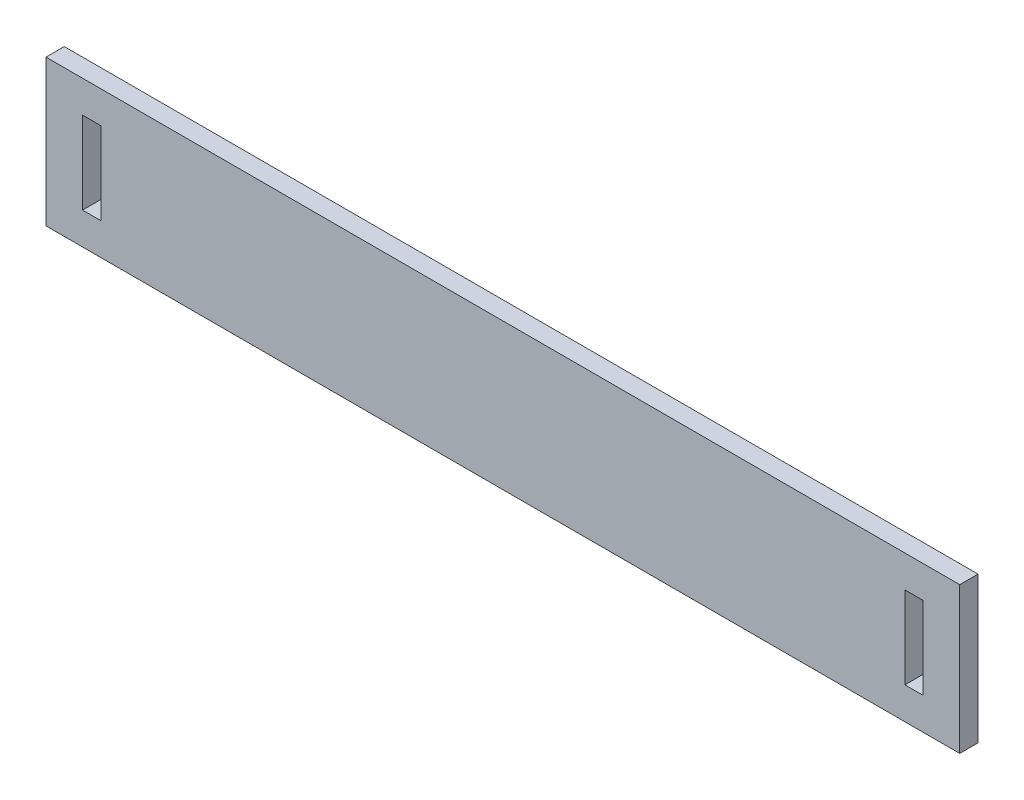
ISO-10303-21;
HEADER;
FILE_DESCRIPTION(('STEP AP214'),'2;1');
FILE_NAME('part.step','',(''),(''),'','','');
FILE_SCHEMA(('AUTOMOTIVE_DESIGN { 1 0 10303 214 1 1 1 1 }'));
ENDSEC;
DATA;
#1=APPLICATION_CONTEXT('core data for automotive mechanical design processes');
#2=APPLICATION_PROTOCOL_DEFINITION('international standard','automotive_design',2000,#1);
#3=PRODUCT_CONTEXT('',#1,'mechanical');
#4=PRODUCT('Part','Part','',(#3));
#5=PRODUCT_RELATED_PRODUCT_CATEGORY('part','',(#4));
#6=PRODUCT_DEFINITION_FORMATION('','',#4);
#7=PRODUCT_DEFINITION_CONTEXT('part definition',#1,'design');
#8=PRODUCT_DEFINITION('design','',#6,#7);
#9=PRODUCT_DEFINITION_SHAPE('','',#8);
#10=(LENGTH_UNIT() NAMED_UNIT(*) SI_UNIT(.MILLI.,.METRE.));
#11=(NAMED_UNIT(*) PLANE_ANGLE_UNIT() SI_UNIT($,.RADIAN.));
#12=(NAMED_UNIT(*) SI_UNIT($,.STERADIAN.) SOLID_ANGLE_UNIT());
#13=UNCERTAINTY_MEASURE_WITH_UNIT(LENGTH_MEASURE(1.E-05),#10,'distance_accuracy_value','');
#14=(GEOMETRIC_REPRESENTATION_CONTEXT(3) GLOBAL_UNCERTAINTY_ASSIGNED_CONTEXT((#13)) GLOBAL_UNIT_ASSIGNED_CONTEXT((#10,
#11,#12)) REPRESENTATION_CONTEXT('',''));
#15=CARTESIAN_POINT('',(0.,0.,0.));
#16=DIRECTION('',(0.,0.,1.));
#17=DIRECTION('',(1.,0.,0.));
#18=AXIS2_PLACEMENT_3D('',#15,#16,#17);
#19=CARTESIAN_POINT('',(-62.1174091184073,42.8700956937799,4.));
#20=DIRECTION('',(1.,0.,0.));
#21=DIRECTION('',(0.,0.,-1.));
#22=AXIS2_PLACEMENT_3D('',#19,#20,#21);
#23=PLANE('',#22);
#24=DIRECTION('',(0.,-1.,0.));
#25=VECTOR('',#24,1.);
#26=CARTESIAN_POINT('',(-62.1174091184073,42.8700956937799,0.));
#27=LINE('',#26,#25);
#28=CARTESIAN_POINT('',(-62.1174091184073,42.8700956937799,0.));
#29=VERTEX_POINT('',#28);
#30=CARTESIAN_POINT('',(-62.1174091184073,10.8700956937799,0.));
#31=VERTEX_POINT('',#30);
#32=EDGE_CURVE('E183',#29,#31,#27,.T.);
#33=ORIENTED_EDGE('',*,*,#32,.T.);
#34=DIRECTION('',(0.,0.,-1.));
#35=VECTOR('',#34,1.);
#36=CARTESIAN_POINT('',(-62.1174091184073,10.8700956937799,4.));
#37=LINE('',#36,#35);
#38=CARTESIAN_POINT('',(-62.1174091184073,10.8700956937799,4.));
#39=VERTEX_POINT('',#38);
#40=EDGE_CURVE('E11',#39,#31,#37,.T.);
#41=ORIENTED_EDGE('',*,*,#40,.F.);
#42=DIRECTION('',(0.,-1.,0.));
#43=VECTOR('',#42,1.);
#44=CARTESIAN_POINT('',(-62.1174091184073,42.8700956937799,4.));
#45=LINE('',#44,#43);
#46=CARTESIAN_POINT('',(-62.1174091184073,42.8700956937799,4.));
#47=VERTEX_POINT('',#46);
#48=EDGE_CURVE('E190',#47,#39,#45,.T.);
#49=ORIENTED_EDGE('',*,*,#48,.F.);
#50=DIRECTION('',(0.,0.,-1.));
#51=VECTOR('',#50,1.);
#52=CARTESIAN_POINT('',(-62.1174091184073,42.8700956937799,4.));
#53=LINE('',#52,#51);
#54=EDGE_CURVE('E200',#47,#29,#53,.T.);
#55=ORIENTED_EDGE('',*,*,#54,.T.);
#56=EDGE_LOOP('',(#33,#41,#49,#55));
#57=FACE_BOUND('',#56,.T.);
#58=ADVANCED_FACE('F33',(#57),#23,.F.);
#59=CARTESIAN_POINT('',(-62.1174091184073,10.8700956937799,4.));
#60=DIRECTION('',(0.,1.,0.));
#61=DIRECTION('',(0.,0.,1.));
#62=AXIS2_PLACEMENT_3D('',#59,#60,#61);
#63=PLANE('',#62);
#64=DIRECTION('',(1.,0.,0.));
#65=VECTOR('',#64,1.);
#66=CARTESIAN_POINT('',(-62.1174091184073,10.8700956937799,0.));
#67=LINE('',#66,#65);
#68=CARTESIAN_POINT('',(137.882590881593,10.8700956937799,0.));
#69=VERTEX_POINT('',#68);
#70=EDGE_CURVE('E203',#31,#69,#67,.T.);
#71=ORIENTED_EDGE('',*,*,#70,.T.);
#72=DIRECTION('',(0.,0.,-1.));
#73=VECTOR('',#72,1.);
#74=CARTESIAN_POINT('',(137.882590881593,10.8700956937799,4.));
#75=LINE('',#74,#73);
#76=CARTESIAN_POINT('',(137.882590881593,10.8700956937799,4.));
#77=VERTEX_POINT('',#76);
#78=EDGE_CURVE('E40',#77,#69,#75,.T.);
#79=ORIENTED_EDGE('',*,*,#78,.F.);
#80=DIRECTION('',(1.,0.,0.));
#81=VECTOR('',#80,1.);
#82=CARTESIAN_POINT('',(-62.1174091184073,10.8700956937799,4.));
#83=LINE('',#82,#81);
#84=EDGE_CURVE('E193',#39,#77,#83,.T.);
#85=ORIENTED_EDGE('',*,*,#84,.F.);
#86=ORIENTED_EDGE('',*,*,#40,.T.);
#87=EDGE_LOOP('',(#71,#79,#85,#86));
#88=FACE_BOUND('',#87,.T.);
#89=ADVANCED_FACE('F232',(#88),#63,.F.);
#90=CARTESIAN_POINT('',(137.882590881593,42.8700956937799,4.));
#91=DIRECTION('',(-1.,0.,0.));
#92=DIRECTION('',(0.,0.,1.));
#93=AXIS2_PLACEMENT_3D('',#90,#91,#92);
#94=PLANE('',#93);
#95=DIRECTION('',(0.,1.,0.));
#96=VECTOR('',#95,1.);
#97=CARTESIAN_POINT('',(137.882590881593,42.8700956937799,0.));
#98=LINE('',#97,#96);
#99=CARTESIAN_POINT('',(137.882590881593,42.8700956937799,0.));
#100=VERTEX_POINT('',#99);
#101=EDGE_CURVE('E205',#69,#100,#98,.T.);
#102=ORIENTED_EDGE('',*,*,#101,.T.);
#103=DIRECTION('',(0.,0.,-1.));
#104=VECTOR('',#103,1.);
#105=CARTESIAN_POINT('',(137.882590881593,42.8700956937799,4.));
#106=LINE('',#105,#104);
#107=CARTESIAN_POINT('',(137.882590881593,42.8700956937799,4.));
#108=VERTEX_POINT('',#107);
#109=EDGE_CURVE('E210',#108,#100,#106,.T.);
#110=ORIENTED_EDGE('',*,*,#109,.F.);
#111=DIRECTION('',(0.,1.,0.));
#112=VECTOR('',#111,1.);
#113=CARTESIAN_POINT('',(137.882590881593,42.8700956937799,4.));
#114=LINE('',#113,#112);
#115=EDGE_CURVE('E196',#77,#108,#114,.T.);
#116=ORIENTED_EDGE('',*,*,#115,.F.);
#117=ORIENTED_EDGE('',*,*,#78,.T.);
#118=EDGE_LOOP('',(#102,#110,#116,#117));
#119=FACE_BOUND('',#118,.T.);
#120=ADVANCED_FACE('F217',(#119),#94,.F.);
#121=CARTESIAN_POINT('',(-62.1174091184073,42.8700956937799,4.));
#122=DIRECTION('',(0.,-1.,0.));
#123=DIRECTION('',(0.,0.,-1.));
#124=AXIS2_PLACEMENT_3D('',#121,#122,#123);
#125=PLANE('',#124);
#126=DIRECTION('',(-1.,0.,0.));
#127=VECTOR('',#126,1.);
#128=CARTESIAN_POINT('',(-62.1174091184073,42.8700956937799,0.));
#129=LINE('',#128,#127);
#130=EDGE_CURVE('E194',#100,#29,#129,.T.);
#131=ORIENTED_EDGE('',*,*,#130,.T.);
#132=ORIENTED_EDGE('',*,*,#54,.F.);
#133=DIRECTION('',(-1.,0.,0.));
#134=VECTOR('',#133,1.);
#135=CARTESIAN_POINT('',(-62.1174091184073,42.8700956937799,4.));
#136=LINE('',#135,#134);
#137=EDGE_CURVE('E198',#108,#47,#136,.T.);
#138=ORIENTED_EDGE('',*,*,#137,.F.);
#139=ORIENTED_EDGE('',*,*,#109,.T.);
#140=EDGE_LOOP('',(#131,#132,#138,#139));
#141=FACE_BOUND('',#140,.T.);
#142=ADVANCED_FACE('F225',(#141),#125,.F.);
#143=CARTESIAN_POINT('',(0.,0.,4.));
#144=DIRECTION('',(0.,0.,1.));
#145=DIRECTION('',(1.,0.,0.));
#146=AXIS2_PLACEMENT_3D('',#143,#144,#145);
#147=PLANE('',#146);
#148=DIRECTION('',(0.,-1.,0.));
#149=VECTOR('',#148,1.);
#150=CARTESIAN_POINT('',(125.882590881593,35.8700956937799,4.));
#151=LINE('',#150,#149);
#152=CARTESIAN_POINT('',(125.882590881593,35.8700956937799,4.));
#153=VERTEX_POINT('',#152);
#154=CARTESIAN_POINT('',(125.882590881593,17.8700956937799,4.));
#155=VERTEX_POINT('',#154);
#156=EDGE_CURVE('E47',#153,#155,#151,.T.);
#157=ORIENTED_EDGE('',*,*,#156,.F.);
#158=DIRECTION('',(-1.,0.,0.));
#159=VECTOR('',#158,1.);
#160=CARTESIAN_POINT('',(125.882590881593,35.8700956937799,4.));
#161=LINE('',#160,#159);
#162=CARTESIAN_POINT('',(129.882590881593,35.8700956937799,4.));
#163=VERTEX_POINT('',#162);
#164=EDGE_CURVE('E139',#163,#153,#161,.T.);
#165=ORIENTED_EDGE('',*,*,#164,.F.);
#166=DIRECTION('',(0.,1.,0.));
#167=VECTOR('',#166,1.);
#168=CARTESIAN_POINT('',(129.882590881593,35.8700956937799,4.));
#169=LINE('',#168,#167);
#170=CARTESIAN_POINT('',(129.882590881593,17.8700956937799,4.));
#171=VERTEX_POINT('',#170);
#172=EDGE_CURVE('E142',#171,#163,#169,.T.);
#173=ORIENTED_EDGE('',*,*,#172,.F.);
#174=DIRECTION('',(1.,0.,0.));
#175=VECTOR('',#174,1.);
#176=CARTESIAN_POINT('',(125.882590881593,17.8700956937799,4.));
#177=LINE('',#176,#175);
#178=EDGE_CURVE('E148',#155,#171,#177,.T.);
#179=ORIENTED_EDGE('',*,*,#178,.F.);
#180=EDGE_LOOP('',(#157,#165,#173,#179));
#181=FACE_BOUND('',#180,.T.);
#182=DIRECTION('',(0.,-1.,0.));
#183=VECTOR('',#182,1.);
#184=CARTESIAN_POINT('',(-54.1174091184073,35.8700956937799,4.));
#185=LINE('',#184,#183);
#186=CARTESIAN_POINT('',(-54.1174091184073,35.8700956937799,4.));
#187=VERTEX_POINT('',#186);
#188=CARTESIAN_POINT('',(-54.1174091184073,17.8700956937799,4.));
#189=VERTEX_POINT('',#188);
#190=EDGE_CURVE('E154',#187,#189,#185,.T.);
#191=ORIENTED_EDGE('',*,*,#190,.F.);
#192=DIRECTION('',(-1.,0.,0.));
#193=VECTOR('',#192,1.);
#194=CARTESIAN_POINT('',(-54.1174091184073,35.8700956937799,4.));
#195=LINE('',#194,#193);
#196=CARTESIAN_POINT('',(-50.1174091184073,35.8700956937799,4.));
#197=VERTEX_POINT('',#196);
#198=EDGE_CURVE('E162',#197,#187,#195,.T.);
#199=ORIENTED_EDGE('',*,*,#198,.F.);
#200=DIRECTION('',(0.,1.,0.));
#201=VECTOR('',#200,1.);
#202=CARTESIAN_POINT('',(-50.1174091184073,35.8700956937799,4.));
#203=LINE('',#202,#201);
#204=CARTESIAN_POINT('',(-50.1174091184073,17.8700956937799,4.));
#205=VERTEX_POINT('',#204);
#206=EDGE_CURVE('E176',#205,#197,#203,.T.);
#207=ORIENTED_EDGE('',*,*,#206,.F.);
#208=DIRECTION('',(1.,0.,0.));
#209=VECTOR('',#208,1.);
#210=CARTESIAN_POINT('',(-54.1174091184073,17.8700956937799,4.));
#211=LINE('',#210,#209);
#212=EDGE_CURVE('E173',#189,#205,#211,.T.);
#213=ORIENTED_EDGE('',*,*,#212,.F.);
#214=EDGE_LOOP('',(#191,#199,#207,#213));
#215=FACE_BOUND('',#214,.T.);
#216=ORIENTED_EDGE('',*,*,#48,.T.);
#217=ORIENTED_EDGE('',*,*,#84,.T.);
#218=ORIENTED_EDGE('',*,*,#115,.T.);
#219=ORIENTED_EDGE('',*,*,#137,.T.);
#220=EDGE_LOOP('',(#216,#217,#218,#219));
#221=FACE_BOUND('',#220,.T.);
#222=ADVANCED_FACE('F231',(#181,#215,#221),#147,.T.);
#223=CARTESIAN_POINT('',(0.,0.,0.));
#224=DIRECTION('',(0.,0.,1.));
#225=DIRECTION('',(1.,0.,0.));
#226=AXIS2_PLACEMENT_3D('',#223,#224,#225);
#227=PLANE('',#226);
#228=DIRECTION('',(-1.,0.,0.));
#229=VECTOR('',#228,1.);
#230=CARTESIAN_POINT('',(125.882590881593,35.8700956937799,0.));
#231=LINE('',#230,#229);
#232=CARTESIAN_POINT('',(129.882590881593,35.8700956937799,0.));
#233=VERTEX_POINT('',#232);
#234=CARTESIAN_POINT('',(125.882590881593,35.8700956937799,0.));
#235=VERTEX_POINT('',#234);
#236=EDGE_CURVE('E129',#233,#235,#231,.T.);
#237=ORIENTED_EDGE('',*,*,#236,.T.);
#238=DIRECTION('',(0.,-1.,0.));
#239=VECTOR('',#238,1.);
#240=CARTESIAN_POINT('',(125.882590881593,35.8700956937799,0.));
#241=LINE('',#240,#239);
#242=CARTESIAN_POINT('',(125.882590881593,17.8700956937799,0.));
#243=VERTEX_POINT('',#242);
#244=EDGE_CURVE('E123',#235,#243,#241,.T.);
#245=ORIENTED_EDGE('',*,*,#244,.T.);
#246=DIRECTION('',(1.,0.,0.));
#247=VECTOR('',#246,1.);
#248=CARTESIAN_POINT('',(125.882590881593,17.8700956937799,0.));
#249=LINE('',#248,#247);
#250=CARTESIAN_POINT('',(129.882590881593,17.8700956937799,0.));
#251=VERTEX_POINT('',#250);
#252=EDGE_CURVE('E132',#243,#251,#249,.T.);
#253=ORIENTED_EDGE('',*,*,#252,.T.);
#254=DIRECTION('',(0.,1.,0.));
#255=VECTOR('',#254,1.);
#256=CARTESIAN_POINT('',(129.882590881593,35.8700956937799,0.));
#257=LINE('',#256,#255);
#258=EDGE_CURVE('E55',#251,#233,#257,.T.);
#259=ORIENTED_EDGE('',*,*,#258,.T.);
#260=EDGE_LOOP('',(#237,#245,#253,#259));
#261=FACE_BOUND('',#260,.T.);
#262=DIRECTION('',(-1.,0.,0.));
#263=VECTOR('',#262,1.);
#264=CARTESIAN_POINT('',(-54.1174091184073,35.8700956937799,0.));
#265=LINE('',#264,#263);
#266=CARTESIAN_POINT('',(-50.1174091184073,35.8700956937799,0.));
#267=VERTEX_POINT('',#266);
#268=CARTESIAN_POINT('',(-54.1174091184073,35.8700956937799,0.));
#269=VERTEX_POINT('',#268);
#270=EDGE_CURVE('E168',#267,#269,#265,.T.);
#271=ORIENTED_EDGE('',*,*,#270,.T.);
#272=DIRECTION('',(0.,-1.,0.));
#273=VECTOR('',#272,1.);
#274=CARTESIAN_POINT('',(-54.1174091184073,35.8700956937799,0.));
#275=LINE('',#274,#273);
#276=CARTESIAN_POINT('',(-54.1174091184073,17.8700956937799,0.));
#277=VERTEX_POINT('',#276);
#278=EDGE_CURVE('E158',#269,#277,#275,.T.);
#279=ORIENTED_EDGE('',*,*,#278,.T.);
#280=DIRECTION('',(1.,0.,0.));
#281=VECTOR('',#280,1.);
#282=CARTESIAN_POINT('',(-54.1174091184073,17.8700956937799,0.));
#283=LINE('',#282,#281);
#284=CARTESIAN_POINT('',(-50.1174091184073,17.8700956937799,0.));
#285=VERTEX_POINT('',#284);
#286=EDGE_CURVE('E161',#277,#285,#283,.T.);
#287=ORIENTED_EDGE('',*,*,#286,.T.);
#288=DIRECTION('',(0.,1.,0.));
#289=VECTOR('',#288,1.);
#290=CARTESIAN_POINT('',(-50.1174091184073,35.8700956937799,0.));
#291=LINE('',#290,#289);
#292=EDGE_CURVE('E165',#285,#267,#291,.T.);
#293=ORIENTED_EDGE('',*,*,#292,.T.);
#294=EDGE_LOOP('',(#271,#279,#287,#293));
#295=FACE_BOUND('',#294,.T.);
#296=ORIENTED_EDGE('',*,*,#32,.F.);
#297=ORIENTED_EDGE('',*,*,#130,.F.);
#298=ORIENTED_EDGE('',*,*,#101,.F.);
#299=ORIENTED_EDGE('',*,*,#70,.F.);
#300=EDGE_LOOP('',(#296,#297,#298,#299));
#301=FACE_BOUND('',#300,.T.);
#302=ADVANCED_FACE('F136',(#261,#295,#301),#227,.F.);
#303=CARTESIAN_POINT('',(-54.1174091184073,35.8700956937799,0.));
#304=DIRECTION('',(-1.,0.,0.));
#305=DIRECTION('',(0.,0.,1.));
#306=AXIS2_PLACEMENT_3D('',#303,#304,#305);
#307=PLANE('',#306);
#308=ORIENTED_EDGE('',*,*,#190,.T.);
#309=DIRECTION('',(0.,0.,1.));
#310=VECTOR('',#309,1.);
#311=CARTESIAN_POINT('',(-54.1174091184073,17.8700956937799,0.));
#312=LINE('',#311,#310);
#313=EDGE_CURVE('E171',#277,#189,#312,.T.);
#314=ORIENTED_EDGE('',*,*,#313,.F.);
#315=ORIENTED_EDGE('',*,*,#278,.F.);
#316=DIRECTION('',(0.,0.,1.));
#317=VECTOR('',#316,1.);
#318=CARTESIAN_POINT('',(-54.1174091184073,35.8700956937799,0.));
#319=LINE('',#318,#317);
#320=EDGE_CURVE('E181',#269,#187,#319,.T.);
#321=ORIENTED_EDGE('',*,*,#320,.T.);
#322=EDGE_LOOP('',(#308,#314,#315,#321));
#323=FACE_BOUND('',#322,.T.);
#324=ADVANCED_FACE('F244',(#323),#307,.F.);
#325=CARTESIAN_POINT('',(-54.1174091184073,35.8700956937799,0.));
#326=DIRECTION('',(0.,1.,0.));
#327=DIRECTION('',(0.,0.,1.));
#328=AXIS2_PLACEMENT_3D('',#325,#326,#327);
#329=PLANE('',#328);
#330=ORIENTED_EDGE('',*,*,#198,.T.);
#331=ORIENTED_EDGE('',*,*,#320,.F.);
#332=ORIENTED_EDGE('',*,*,#270,.F.);
#333=DIRECTION('',(0.,0.,1.));
#334=VECTOR('',#333,1.);
#335=CARTESIAN_POINT('',(-50.1174091184073,35.8700956937799,0.));
#336=LINE('',#335,#334);
#337=EDGE_CURVE('E184',#267,#197,#336,.T.);
#338=ORIENTED_EDGE('',*,*,#337,.T.);
#339=EDGE_LOOP('',(#330,#331,#332,#338));
#340=FACE_BOUND('',#339,.T.);
#341=ADVANCED_FACE('F250',(#340),#329,.F.);
#342=CARTESIAN_POINT('',(-50.1174091184073,35.8700956937799,0.));
#343=DIRECTION('',(1.,0.,0.));
#344=DIRECTION('',(0.,1.,0.));
#345=AXIS2_PLACEMENT_3D('',#342,#343,#344);
#346=PLANE('',#345);
#347=ORIENTED_EDGE('',*,*,#206,.T.);
#348=ORIENTED_EDGE('',*,*,#337,.F.);
#349=ORIENTED_EDGE('',*,*,#292,.F.);
#350=DIRECTION('',(0.,0.,1.));
#351=VECTOR('',#350,1.);
#352=CARTESIAN_POINT('',(-50.1174091184073,17.8700956937799,0.));
#353=LINE('',#352,#351);
#354=EDGE_CURVE('E186',#285,#205,#353,.T.);
#355=ORIENTED_EDGE('',*,*,#354,.T.);
#356=EDGE_LOOP('',(#347,#348,#349,#355));
#357=FACE_BOUND('',#356,.T.);
#358=ADVANCED_FACE('F255',(#357),#346,.F.);
#359=CARTESIAN_POINT('',(-54.1174091184073,17.8700956937799,0.));
#360=DIRECTION('',(0.,-1.,0.));
#361=DIRECTION('',(0.,0.,-1.));
#362=AXIS2_PLACEMENT_3D('',#359,#360,#361);
#363=PLANE('',#362);
#364=ORIENTED_EDGE('',*,*,#212,.T.);
#365=ORIENTED_EDGE('',*,*,#354,.F.);
#366=ORIENTED_EDGE('',*,*,#286,.F.);
#367=ORIENTED_EDGE('',*,*,#313,.T.);
#368=EDGE_LOOP('',(#364,#365,#366,#367));
#369=FACE_BOUND('',#368,.T.);
#370=ADVANCED_FACE('F252',(#369),#363,.F.);
#371=CARTESIAN_POINT('',(125.882590881593,35.8700956937799,0.));
#372=DIRECTION('',(-1.,0.,0.));
#373=DIRECTION('',(0.,0.,1.));
#374=AXIS2_PLACEMENT_3D('',#371,#372,#373);
#375=PLANE('',#374);
#376=ORIENTED_EDGE('',*,*,#156,.T.);
#377=DIRECTION('',(0.,0.,1.));
#378=VECTOR('',#377,1.);
#379=CARTESIAN_POINT('',(125.882590881593,17.8700956937799,0.));
#380=LINE('',#379,#378);
#381=EDGE_CURVE('E119',#243,#155,#380,.T.);
#382=ORIENTED_EDGE('',*,*,#381,.F.);
#383=ORIENTED_EDGE('',*,*,#244,.F.);
#384=DIRECTION('',(0.,0.,1.));
#385=VECTOR('',#384,1.);
#386=CARTESIAN_POINT('',(125.882590881593,35.8700956937799,0.));
#387=LINE('',#386,#385);
#388=EDGE_CURVE('E152',#235,#153,#387,.T.);
#389=ORIENTED_EDGE('',*,*,#388,.T.);
#390=EDGE_LOOP('',(#376,#382,#383,#389));
#391=FACE_BOUND('',#390,.T.);
#392=ADVANCED_FACE('F121',(#391),#375,.F.);
#393=CARTESIAN_POINT('',(125.882590881593,35.8700956937799,0.));
#394=DIRECTION('',(0.,1.,0.));
#395=DIRECTION('',(0.,0.,1.));
#396=AXIS2_PLACEMENT_3D('',#393,#394,#395);
#397=PLANE('',#396);
#398=ORIENTED_EDGE('',*,*,#164,.T.);
#399=ORIENTED_EDGE('',*,*,#388,.F.);
#400=ORIENTED_EDGE('',*,*,#236,.F.);
#401=DIRECTION('',(0.,0.,1.));
#402=VECTOR('',#401,1.);
#403=CARTESIAN_POINT('',(129.882590881593,35.8700956937799,0.));
#404=LINE('',#403,#402);
#405=EDGE_CURVE('E155',#233,#163,#404,.T.);
#406=ORIENTED_EDGE('',*,*,#405,.T.);
#407=EDGE_LOOP('',(#398,#399,#400,#406));
#408=FACE_BOUND('',#407,.T.);
#409=ADVANCED_FACE('F265',(#408),#397,.F.);
#410=CARTESIAN_POINT('',(129.882590881593,35.8700956937799,0.));
#411=DIRECTION('',(1.,0.,0.));
#412=DIRECTION('',(0.,0.,-1.));
#413=AXIS2_PLACEMENT_3D('',#410,#411,#412);
#414=PLANE('',#413);
#415=ORIENTED_EDGE('',*,*,#172,.T.);
#416=ORIENTED_EDGE('',*,*,#405,.F.);
#417=ORIENTED_EDGE('',*,*,#258,.F.);
#418=DIRECTION('',(0.,0.,1.));
#419=VECTOR('',#418,1.);
#420=CARTESIAN_POINT('',(129.882590881593,17.8700956937799,0.));
#421=LINE('',#420,#419);
#422=EDGE_CURVE('E128',#251,#171,#421,.T.);
#423=ORIENTED_EDGE('',*,*,#422,.T.);
#424=EDGE_LOOP('',(#415,#416,#417,#423));
#425=FACE_BOUND('',#424,.T.);
#426=ADVANCED_FACE('F268',(#425),#414,.F.);
#427=CARTESIAN_POINT('',(125.882590881593,17.8700956937799,0.));
#428=DIRECTION('',(0.,-1.,0.));
#429=DIRECTION('',(0.,0.,-1.));
#430=AXIS2_PLACEMENT_3D('',#427,#428,#429);
#431=PLANE('',#430);
#432=ORIENTED_EDGE('',*,*,#178,.T.);
#433=ORIENTED_EDGE('',*,*,#422,.F.);
#434=ORIENTED_EDGE('',*,*,#252,.F.);
#435=ORIENTED_EDGE('',*,*,#381,.T.);
#436=EDGE_LOOP('',(#432,#433,#434,#435));
#437=FACE_BOUND('',#436,.T.);
#438=ADVANCED_FACE('F133',(#437),#431,.F.);
#439=CLOSED_SHELL('',(#58,#89,#120,#142,#222,#302,#324,#341,#358,#370,#392,#409,#426,#438));
#440=MANIFOLD_SOLID_BREP('B2',#439);
#441=ADVANCED_BREP_SHAPE_REPRESENTATION('',(#18,#440),#14);
#442=SHAPE_DEFINITION_REPRESENTATION(#9,#441);
ENDSEC;
END-ISO-10303-21;
